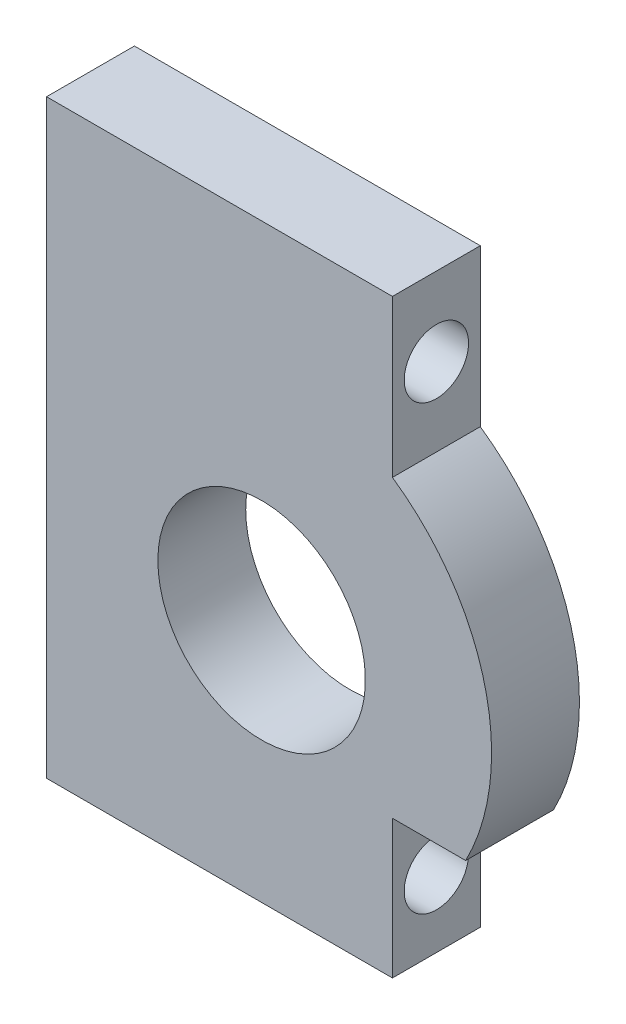
ISO-10303-21;
HEADER;
FILE_DESCRIPTION(('STEP AP214'),'2;1');
FILE_NAME('part.step','',(''),(''),'','','');
FILE_SCHEMA(('AUTOMOTIVE_DESIGN { 1 0 10303 214 1 1 1 1 }'));
ENDSEC;
DATA;
#1=APPLICATION_CONTEXT('core data for automotive mechanical design processes');
#2=APPLICATION_PROTOCOL_DEFINITION('international standard','automotive_design',2000,#1);
#3=PRODUCT_CONTEXT('',#1,'mechanical');
#4=PRODUCT('Part','Part','',(#3));
#5=PRODUCT_RELATED_PRODUCT_CATEGORY('part','',(#4));
#6=PRODUCT_DEFINITION_FORMATION('','',#4);
#7=PRODUCT_DEFINITION_CONTEXT('part definition',#1,'design');
#8=PRODUCT_DEFINITION('design','',#6,#7);
#9=PRODUCT_DEFINITION_SHAPE('','',#8);
#10=(LENGTH_UNIT() NAMED_UNIT(*) SI_UNIT(.MILLI.,.METRE.));
#11=(NAMED_UNIT(*) PLANE_ANGLE_UNIT() SI_UNIT($,.RADIAN.));
#12=(NAMED_UNIT(*) SI_UNIT($,.STERADIAN.) SOLID_ANGLE_UNIT());
#13=UNCERTAINTY_MEASURE_WITH_UNIT(LENGTH_MEASURE(1.E-05),#10,'distance_accuracy_value','');
#14=(GEOMETRIC_REPRESENTATION_CONTEXT(3) GLOBAL_UNCERTAINTY_ASSIGNED_CONTEXT((#13)) GLOBAL_UNIT_ASSIGNED_CONTEXT((#10,
#11,#12)) REPRESENTATION_CONTEXT('',''));
#15=CARTESIAN_POINT('',(0.,0.,0.));
#16=DIRECTION('',(0.,0.,1.));
#17=DIRECTION('',(1.,0.,0.));
#18=AXIS2_PLACEMENT_3D('',#15,#16,#17);
#19=CARTESIAN_POINT('',(19.1,36.72,-10.025));
#20=DIRECTION('',(-1.,0.,0.));
#21=DIRECTION('',(0.,0.,1.));
#22=AXIS2_PLACEMENT_3D('',#19,#20,#21);
#23=PLANE('',#22);
#24=CARTESIAN_POINT('',(19.1,73.72,-13.2));
#25=DIRECTION('',(-1.,0.,0.));
#26=DIRECTION('',(0.,0.,1.));
#27=AXIS2_PLACEMENT_3D('',#24,#25,#26);
#28=CIRCLE('',#27,2.32500000000001);
#29=CARTESIAN_POINT('',(19.1,73.72,-10.875));
#30=VERTEX_POINT('',#29);
#31=EDGE_CURVE('E217',#30,#30,#28,.F.);
#32=ORIENTED_EDGE('',*,*,#31,.T.);
#33=EDGE_LOOP('',(#32));
#34=FACE_BOUND('',#33,.T.);
#35=CARTESIAN_POINT('',(19.1,41.72,-13.2));
#36=DIRECTION('',(-1.,0.,0.));
#37=DIRECTION('',(0.,0.,1.));
#38=AXIS2_PLACEMENT_3D('',#35,#36,#37);
#39=CIRCLE('',#38,2.32500000000001);
#40=CARTESIAN_POINT('',(19.1,41.72,-10.875));
#41=VERTEX_POINT('',#40);
#42=EDGE_CURVE('E221',#41,#41,#39,.F.);
#43=ORIENTED_EDGE('',*,*,#42,.T.);
#44=EDGE_LOOP('',(#43));
#45=FACE_BOUND('',#44,.T.);
#46=DIRECTION('',(0.,0.,-1.));
#47=VECTOR('',#46,1.);
#48=CARTESIAN_POINT('',(19.1,79.3850000000001,-10.025));
#49=LINE('',#48,#47);
#50=CARTESIAN_POINT('',(19.1,79.3850000000001,-10.025));
#51=VERTEX_POINT('',#50);
#52=CARTESIAN_POINT('',(19.1,79.3850000000001,-16.375));
#53=VERTEX_POINT('',#52);
#54=EDGE_CURVE('E34',#51,#53,#49,.T.);
#55=ORIENTED_EDGE('',*,*,#54,.T.);
#56=DIRECTION('',(0.,1.,0.));
#57=VECTOR('',#56,1.);
#58=CARTESIAN_POINT('',(19.1,36.72,-16.375));
#59=LINE('',#58,#57);
#60=CARTESIAN_POINT('',(19.1,36.72,-16.375));
#61=VERTEX_POINT('',#60);
#62=EDGE_CURVE('E89',#61,#53,#59,.T.);
#63=ORIENTED_EDGE('',*,*,#62,.F.);
#64=DIRECTION('',(0.,0.,-1.));
#65=VECTOR('',#64,1.);
#66=CARTESIAN_POINT('',(19.1,36.72,-10.025));
#67=LINE('',#66,#65);
#68=CARTESIAN_POINT('',(19.1,36.72,-10.025));
#69=VERTEX_POINT('',#68);
#70=EDGE_CURVE('E11',#69,#61,#67,.T.);
#71=ORIENTED_EDGE('',*,*,#70,.F.);
#72=DIRECTION('',(0.,1.,0.));
#73=VECTOR('',#72,1.);
#74=CARTESIAN_POINT('',(19.1,36.72,-10.025));
#75=LINE('',#74,#73);
#76=EDGE_CURVE('E90',#69,#51,#75,.T.);
#77=ORIENTED_EDGE('',*,*,#76,.T.);
#78=EDGE_LOOP('',(#55,#63,#71,#77));
#79=FACE_BOUND('',#78,.T.);
#80=ADVANCED_FACE('F31',(#34,#45,#79),#23,.T.);
#81=CARTESIAN_POINT('',(19.1,36.72,-10.025));
#82=DIRECTION('',(0.,-1.,0.));
#83=DIRECTION('',(0.,0.,-1.));
#84=AXIS2_PLACEMENT_3D('',#81,#82,#83);
#85=PLANE('',#84);
#86=ORIENTED_EDGE('',*,*,#70,.T.);
#87=DIRECTION('',(-1.,0.,0.));
#88=VECTOR('',#87,1.);
#89=CARTESIAN_POINT('',(19.1,36.72,-16.375));
#90=LINE('',#89,#88);
#91=CARTESIAN_POINT('',(44.1,36.72,-16.375));
#92=VERTEX_POINT('',#91);
#93=EDGE_CURVE('E108',#92,#61,#90,.T.);
#94=ORIENTED_EDGE('',*,*,#93,.F.);
#95=DIRECTION('',(0.,0.,-1.));
#96=VECTOR('',#95,1.);
#97=CARTESIAN_POINT('',(44.1,36.72,-10.025));
#98=LINE('',#97,#96);
#99=CARTESIAN_POINT('',(44.1,36.72,-10.025));
#100=VERTEX_POINT('',#99);
#101=EDGE_CURVE('E39',#100,#92,#98,.T.);
#102=ORIENTED_EDGE('',*,*,#101,.F.);
#103=DIRECTION('',(-1.,0.,0.));
#104=VECTOR('',#103,1.);
#105=CARTESIAN_POINT('',(19.1,36.72,-10.025));
#106=LINE('',#105,#104);
#107=EDGE_CURVE('E95',#100,#69,#106,.T.);
#108=ORIENTED_EDGE('',*,*,#107,.T.);
#109=EDGE_LOOP('',(#86,#94,#102,#108));
#110=FACE_BOUND('',#109,.T.);
#111=ADVANCED_FACE('F168',(#110),#85,.T.);
#112=CARTESIAN_POINT('',(44.1,36.72,-10.025));
#113=DIRECTION('',(1.,0.,0.));
#114=DIRECTION('',(0.,0.,-1.));
#115=AXIS2_PLACEMENT_3D('',#112,#113,#114);
#116=PLANE('',#115);
#117=CARTESIAN_POINT('',(44.1,41.72,-13.2));
#118=DIRECTION('',(1.,0.,0.));
#119=DIRECTION('',(0.,0.,-1.));
#120=AXIS2_PLACEMENT_3D('',#117,#118,#119);
#121=CIRCLE('',#120,2.32500000000001);
#122=CARTESIAN_POINT('',(44.1,41.72,-15.525));
#123=VERTEX_POINT('',#122);
#124=EDGE_CURVE('E112',#123,#123,#121,.T.);
#125=ORIENTED_EDGE('',*,*,#124,.F.);
#126=EDGE_LOOP('',(#125));
#127=FACE_BOUND('',#126,.T.);
#128=ORIENTED_EDGE('',*,*,#101,.T.);
#129=DIRECTION('',(0.,-1.,0.));
#130=VECTOR('',#129,1.);
#131=CARTESIAN_POINT('',(44.1,36.72,-16.375));
#132=LINE('',#131,#130);
#133=CARTESIAN_POINT('',(44.1,46.72,-16.375));
#134=VERTEX_POINT('',#133);
#135=EDGE_CURVE('E123',#134,#92,#132,.T.);
#136=ORIENTED_EDGE('',*,*,#135,.F.);
#137=DIRECTION('',(0.,0.,-1.));
#138=VECTOR('',#137,1.);
#139=CARTESIAN_POINT('',(44.1,46.72,-10.025));
#140=LINE('',#139,#138);
#141=CARTESIAN_POINT('',(44.1,46.72,-10.025));
#142=VERTEX_POINT('',#141);
#143=EDGE_CURVE('E145',#142,#134,#140,.T.);
#144=ORIENTED_EDGE('',*,*,#143,.F.);
#145=DIRECTION('',(0.,-1.,0.));
#146=VECTOR('',#145,1.);
#147=CARTESIAN_POINT('',(44.1,36.72,-10.025));
#148=LINE('',#147,#146);
#149=EDGE_CURVE('E141',#142,#100,#148,.T.);
#150=ORIENTED_EDGE('',*,*,#149,.T.);
#151=EDGE_LOOP('',(#128,#136,#144,#150));
#152=FACE_BOUND('',#151,.T.);
#153=ADVANCED_FACE('F166',(#127,#152),#116,.T.);
#154=CARTESIAN_POINT('',(44.1,46.72,-10.025));
#155=DIRECTION('',(0.,-1.,0.));
#156=DIRECTION('',(1.,0.,0.));
#157=AXIS2_PLACEMENT_3D('',#154,#155,#156);
#158=PLANE('',#157);
#159=ORIENTED_EDGE('',*,*,#143,.T.);
#160=DIRECTION('',(-1.,0.,0.));
#161=VECTOR('',#160,1.);
#162=CARTESIAN_POINT('',(44.1,46.72,-16.375));
#163=LINE('',#162,#161);
#164=CARTESIAN_POINT('',(49.3933456699384,46.72,-16.375));
#165=VERTEX_POINT('',#164);
#166=EDGE_CURVE('E120',#165,#134,#163,.T.);
#167=ORIENTED_EDGE('',*,*,#166,.F.);
#168=DIRECTION('',(0.,0.,-1.));
#169=VECTOR('',#168,1.);
#170=CARTESIAN_POINT('',(49.3933456699384,46.72,-10.025));
#171=LINE('',#170,#169);
#172=CARTESIAN_POINT('',(49.3933456699384,46.72,-10.025));
#173=VERTEX_POINT('',#172);
#174=EDGE_CURVE('E147',#173,#165,#171,.T.);
#175=ORIENTED_EDGE('',*,*,#174,.F.);
#176=DIRECTION('',(-1.,0.,0.));
#177=VECTOR('',#176,1.);
#178=CARTESIAN_POINT('',(44.1,46.72,-10.025));
#179=LINE('',#178,#177);
#180=EDGE_CURVE('E138',#173,#142,#179,.T.);
#181=ORIENTED_EDGE('',*,*,#180,.T.);
#182=EDGE_LOOP('',(#159,#167,#175,#181));
#183=FACE_BOUND('',#182,.T.);
#184=ADVANCED_FACE('F160',(#183),#158,.T.);
#185=CARTESIAN_POINT('',(34.6449999999999,54.3850000000001,-10.025));
#186=DIRECTION('',(0.,0.,-1.));
#187=DIRECTION('',(-1.,0.,0.));
#188=AXIS2_PLACEMENT_3D('',#185,#186,#187);
#189=CYLINDRICAL_SURFACE('',#188,16.6212492009474);
#190=ORIENTED_EDGE('',*,*,#174,.T.);
#191=CARTESIAN_POINT('',(34.6449999999999,54.3850000000001,-16.375));
#192=DIRECTION('',(0.,0.,-1.));
#193=DIRECTION('',(-1.,0.,0.));
#194=AXIS2_PLACEMENT_3D('',#191,#192,#193);
#195=CIRCLE('',#194,16.6212492009474);
#196=CARTESIAN_POINT('',(44.1,68.0549999999999,-16.375));
#197=VERTEX_POINT('',#196);
#198=EDGE_CURVE('E117',#197,#165,#195,.T.);
#199=ORIENTED_EDGE('',*,*,#198,.F.);
#200=DIRECTION('',(0.,0.,-1.));
#201=VECTOR('',#200,1.);
#202=CARTESIAN_POINT('',(44.1,68.0549999999999,-10.025));
#203=LINE('',#202,#201);
#204=CARTESIAN_POINT('',(44.1,68.0549999999999,-10.025));
#205=VERTEX_POINT('',#204);
#206=EDGE_CURVE('E149',#205,#197,#203,.T.);
#207=ORIENTED_EDGE('',*,*,#206,.F.);
#208=CARTESIAN_POINT('',(34.6449999999999,54.3850000000001,-10.025));
#209=DIRECTION('',(0.,0.,-1.));
#210=DIRECTION('',(-1.,0.,0.));
#211=AXIS2_PLACEMENT_3D('',#208,#209,#210);
#212=CIRCLE('',#211,16.6212492009474);
#213=EDGE_CURVE('E135',#205,#173,#212,.T.);
#214=ORIENTED_EDGE('',*,*,#213,.T.);
#215=EDGE_LOOP('',(#190,#199,#207,#214));
#216=FACE_BOUND('',#215,.T.);
#217=ADVANCED_FACE('F157',(#216),#189,.T.);
#218=CARTESIAN_POINT('',(44.1,79.3850000000001,-10.025));
#219=DIRECTION('',(1.,0.,0.));
#220=DIRECTION('',(0.,0.,-1.));
#221=AXIS2_PLACEMENT_3D('',#218,#219,#220);
#222=PLANE('',#221);
#223=CARTESIAN_POINT('',(44.1,73.72,-13.2));
#224=DIRECTION('',(1.,0.,0.));
#225=DIRECTION('',(0.,0.,-1.));
#226=AXIS2_PLACEMENT_3D('',#223,#224,#225);
#227=CIRCLE('',#226,2.32500000000001);
#228=CARTESIAN_POINT('',(44.1,73.72,-15.525));
#229=VERTEX_POINT('',#228);
#230=EDGE_CURVE('E220',#229,#229,#227,.T.);
#231=ORIENTED_EDGE('',*,*,#230,.F.);
#232=EDGE_LOOP('',(#231));
#233=FACE_BOUND('',#232,.T.);
#234=ORIENTED_EDGE('',*,*,#206,.T.);
#235=DIRECTION('',(0.,-1.,0.));
#236=VECTOR('',#235,1.);
#237=CARTESIAN_POINT('',(44.1,79.3850000000001,-16.375));
#238=LINE('',#237,#236);
#239=CARTESIAN_POINT('',(44.1,79.3850000000001,-16.375));
#240=VERTEX_POINT('',#239);
#241=EDGE_CURVE('E102',#240,#197,#238,.T.);
#242=ORIENTED_EDGE('',*,*,#241,.F.);
#243=DIRECTION('',(0.,0.,-1.));
#244=VECTOR('',#243,1.);
#245=CARTESIAN_POINT('',(44.1,79.3850000000001,-10.025));
#246=LINE('',#245,#244);
#247=CARTESIAN_POINT('',(44.1,79.3850000000001,-10.025));
#248=VERTEX_POINT('',#247);
#249=EDGE_CURVE('E94',#248,#240,#246,.T.);
#250=ORIENTED_EDGE('',*,*,#249,.F.);
#251=DIRECTION('',(0.,-1.,0.));
#252=VECTOR('',#251,1.);
#253=CARTESIAN_POINT('',(44.1,79.3850000000001,-10.025));
#254=LINE('',#253,#252);
#255=EDGE_CURVE('E132',#248,#205,#254,.T.);
#256=ORIENTED_EDGE('',*,*,#255,.T.);
#257=EDGE_LOOP('',(#234,#242,#250,#256));
#258=FACE_BOUND('',#257,.T.);
#259=ADVANCED_FACE('F151',(#233,#258),#222,.T.);
#260=CARTESIAN_POINT('',(19.1,79.3850000000001,-10.025));
#261=DIRECTION('',(0.,1.,0.));
#262=DIRECTION('',(0.,0.,1.));
#263=AXIS2_PLACEMENT_3D('',#260,#261,#262);
#264=PLANE('',#263);
#265=ORIENTED_EDGE('',*,*,#249,.T.);
#266=DIRECTION('',(1.,0.,0.));
#267=VECTOR('',#266,1.);
#268=CARTESIAN_POINT('',(19.1,79.3850000000001,-16.375));
#269=LINE('',#268,#267);
#270=EDGE_CURVE('E97',#53,#240,#269,.T.);
#271=ORIENTED_EDGE('',*,*,#270,.F.);
#272=ORIENTED_EDGE('',*,*,#54,.F.);
#273=DIRECTION('',(1.,0.,0.));
#274=VECTOR('',#273,1.);
#275=CARTESIAN_POINT('',(19.1,79.3850000000001,-10.025));
#276=LINE('',#275,#274);
#277=EDGE_CURVE('E130',#51,#248,#276,.T.);
#278=ORIENTED_EDGE('',*,*,#277,.T.);
#279=EDGE_LOOP('',(#265,#271,#272,#278));
#280=FACE_BOUND('',#279,.T.);
#281=ADVANCED_FACE('F98',(#280),#264,.T.);
#282=CARTESIAN_POINT('',(34.6449999999999,54.3850000000001,-10.025));
#283=DIRECTION('',(0.,0.,-1.));
#284=DIRECTION('',(-1.,0.,0.));
#285=AXIS2_PLACEMENT_3D('',#282,#283,#284);
#286=PLANE('',#285);
#287=CARTESIAN_POINT('',(34.6449999999999,54.3850000000001,-10.025));
#288=DIRECTION('',(0.,0.,-1.));
#289=DIRECTION('',(-1.,0.,0.));
#290=AXIS2_PLACEMENT_3D('',#287,#288,#289);
#291=CIRCLE('',#290,7.5);
#292=CARTESIAN_POINT('',(27.1449999999999,54.3850000000001,-10.025));
#293=VERTEX_POINT('',#292);
#294=EDGE_CURVE('E126',#293,#293,#291,.T.);
#295=ORIENTED_EDGE('',*,*,#294,.T.);
#296=EDGE_LOOP('',(#295));
#297=FACE_BOUND('',#296,.T.);
#298=ORIENTED_EDGE('',*,*,#76,.F.);
#299=ORIENTED_EDGE('',*,*,#107,.F.);
#300=ORIENTED_EDGE('',*,*,#149,.F.);
#301=ORIENTED_EDGE('',*,*,#180,.F.);
#302=ORIENTED_EDGE('',*,*,#213,.F.);
#303=ORIENTED_EDGE('',*,*,#255,.F.);
#304=ORIENTED_EDGE('',*,*,#277,.F.);
#305=EDGE_LOOP('',(#298,#299,#300,#301,#302,#303,#304));
#306=FACE_BOUND('',#305,.T.);
#307=ADVANCED_FACE('F163',(#297,#306),#286,.F.);
#308=CARTESIAN_POINT('',(34.6449999999999,54.3850000000001,-10.025));
#309=DIRECTION('',(0.,0.,-1.));
#310=DIRECTION('',(-1.,0.,0.));
#311=AXIS2_PLACEMENT_3D('',#308,#309,#310);
#312=CYLINDRICAL_SURFACE('',#311,7.5);
#313=ORIENTED_EDGE('',*,*,#294,.F.);
#314=EDGE_LOOP('',(#313));
#315=FACE_BOUND('',#314,.T.);
#316=CARTESIAN_POINT('',(34.6449999999999,54.3850000000001,-16.375));
#317=DIRECTION('',(0.,0.,-1.));
#318=DIRECTION('',(-1.,0.,0.));
#319=AXIS2_PLACEMENT_3D('',#316,#317,#318);
#320=CIRCLE('',#319,7.5);
#321=CARTESIAN_POINT('',(27.1449999999999,54.3850000000001,-16.375));
#322=VERTEX_POINT('',#321);
#323=EDGE_CURVE('E109',#322,#322,#320,.T.);
#324=ORIENTED_EDGE('',*,*,#323,.T.);
#325=EDGE_LOOP('',(#324));
#326=FACE_BOUND('',#325,.T.);
#327=ADVANCED_FACE('F191',(#315,#326),#312,.F.);
#328=CARTESIAN_POINT('',(34.6449999999999,54.3850000000001,-16.375));
#329=DIRECTION('',(0.,0.,-1.));
#330=DIRECTION('',(-1.,0.,0.));
#331=AXIS2_PLACEMENT_3D('',#328,#329,#330);
#332=PLANE('',#331);
#333=ORIENTED_EDGE('',*,*,#62,.T.);
#334=ORIENTED_EDGE('',*,*,#270,.T.);
#335=ORIENTED_EDGE('',*,*,#241,.T.);
#336=ORIENTED_EDGE('',*,*,#198,.T.);
#337=ORIENTED_EDGE('',*,*,#166,.T.);
#338=ORIENTED_EDGE('',*,*,#135,.T.);
#339=ORIENTED_EDGE('',*,*,#93,.T.);
#340=EDGE_LOOP('',(#333,#334,#335,#336,#337,#338,#339));
#341=FACE_BOUND('',#340,.T.);
#342=ORIENTED_EDGE('',*,*,#323,.F.);
#343=EDGE_LOOP('',(#342));
#344=FACE_BOUND('',#343,.T.);
#345=ADVANCED_FACE('F105',(#341,#344),#332,.T.);
#346=CARTESIAN_POINT('',(19.099,41.72,-13.2));
#347=DIRECTION('',(1.,0.,0.));
#348=DIRECTION('',(0.,0.,-1.));
#349=AXIS2_PLACEMENT_3D('',#346,#347,#348);
#350=CYLINDRICAL_SURFACE('',#349,2.32500000000001);
#351=ORIENTED_EDGE('',*,*,#42,.F.);
#352=EDGE_LOOP('',(#351));
#353=FACE_BOUND('',#352,.T.);
#354=ORIENTED_EDGE('',*,*,#124,.T.);
#355=EDGE_LOOP('',(#354));
#356=FACE_BOUND('',#355,.T.);
#357=ADVANCED_FACE('F201',(#353,#356),#350,.F.);
#358=CARTESIAN_POINT('',(19.099,73.72,-13.2));
#359=DIRECTION('',(1.,0.,0.));
#360=DIRECTION('',(0.,0.,-1.));
#361=AXIS2_PLACEMENT_3D('',#358,#359,#360);
#362=CYLINDRICAL_SURFACE('',#361,2.32500000000001);
#363=ORIENTED_EDGE('',*,*,#31,.F.);
#364=EDGE_LOOP('',(#363));
#365=FACE_BOUND('',#364,.T.);
#366=ORIENTED_EDGE('',*,*,#230,.T.);
#367=EDGE_LOOP('',(#366));
#368=FACE_BOUND('',#367,.T.);
#369=ADVANCED_FACE('F206',(#365,#368),#362,.F.);
#370=CLOSED_SHELL('',(#80,#111,#153,#184,#217,#259,#281,#307,#327,#345,#357,#369));
#371=MANIFOLD_SOLID_BREP('B2',#370);
#372=ADVANCED_BREP_SHAPE_REPRESENTATION('',(#18,#371),#14);
#373=SHAPE_DEFINITION_REPRESENTATION(#9,#372);
ENDSEC;
END-ISO-10303-21;
